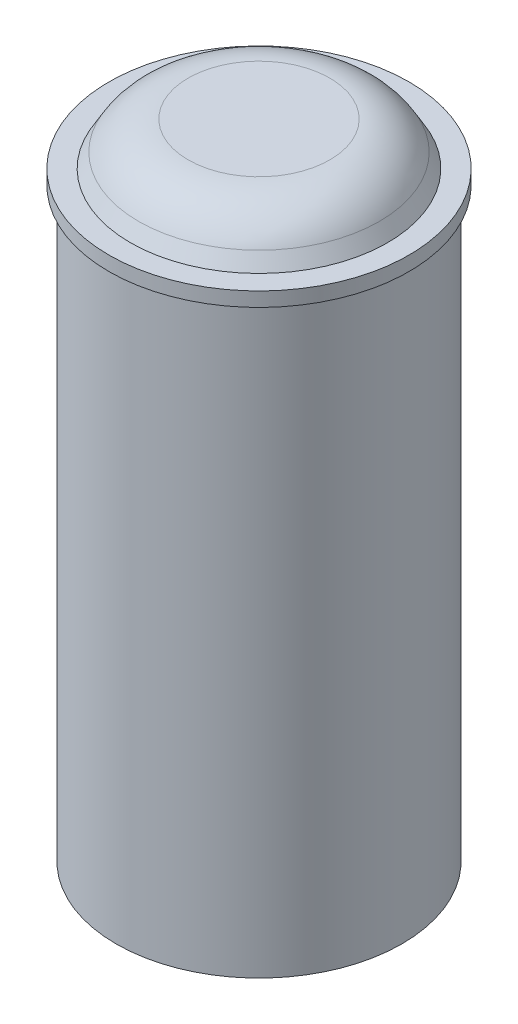
ISO-10303-21;
HEADER;
FILE_DESCRIPTION(('STEP AP214'),'2;1');
FILE_NAME('part.step','',(''),(''),'','','');
FILE_SCHEMA(('AUTOMOTIVE_DESIGN { 1 0 10303 214 1 1 1 1 }'));
ENDSEC;
DATA;
#1=APPLICATION_CONTEXT('core data for automotive mechanical design processes');
#2=APPLICATION_PROTOCOL_DEFINITION('international standard','automotive_design',2000,#1);
#3=PRODUCT_CONTEXT('',#1,'mechanical');
#4=PRODUCT('Part','Part','',(#3));
#5=PRODUCT_RELATED_PRODUCT_CATEGORY('part','',(#4));
#6=PRODUCT_DEFINITION_FORMATION('','',#4);
#7=PRODUCT_DEFINITION_CONTEXT('part definition',#1,'design');
#8=PRODUCT_DEFINITION('design','',#6,#7);
#9=PRODUCT_DEFINITION_SHAPE('','',#8);
#10=(LENGTH_UNIT() NAMED_UNIT(*) SI_UNIT(.MILLI.,.METRE.));
#11=(NAMED_UNIT(*) PLANE_ANGLE_UNIT() SI_UNIT($,.RADIAN.));
#12=(NAMED_UNIT(*) SI_UNIT($,.STERADIAN.) SOLID_ANGLE_UNIT());
#13=UNCERTAINTY_MEASURE_WITH_UNIT(LENGTH_MEASURE(1.E-05),#10,'distance_accuracy_value','');
#14=(GEOMETRIC_REPRESENTATION_CONTEXT(3) GLOBAL_UNCERTAINTY_ASSIGNED_CONTEXT((#13)) GLOBAL_UNIT_ASSIGNED_CONTEXT((#10,
#11,#12)) REPRESENTATION_CONTEXT('',''));
#15=CARTESIAN_POINT('',(0.,0.,0.));
#16=DIRECTION('',(0.,0.,1.));
#17=DIRECTION('',(1.,0.,0.));
#18=AXIS2_PLACEMENT_3D('',#15,#16,#17);
#19=CARTESIAN_POINT('',(0.,53.34,0.));
#20=DIRECTION('',(0.,1.,0.));
#21=DIRECTION('',(0.,0.,1.));
#22=AXIS2_PLACEMENT_3D('',#19,#20,#21);
#23=PLANE('',#22);
#24=CARTESIAN_POINT('',(0.,53.34,0.));
#25=DIRECTION('',(0.,1.,0.));
#26=DIRECTION('',(0.,0.,1.));
#27=AXIS2_PLACEMENT_3D('',#24,#25,#26);
#28=CIRCLE('',#27,13.335);
#29=CARTESIAN_POINT('',(0.,53.34,13.335));
#30=VERTEX_POINT('',#29);
#31=EDGE_CURVE('E170',#30,#30,#28,.T.);
#32=ORIENTED_EDGE('',*,*,#31,.T.);
#33=EDGE_LOOP('',(#32));
#34=FACE_BOUND('',#33,.T.);
#35=CARTESIAN_POINT('',(0.,53.34,0.));
#36=DIRECTION('',(0.,1.,0.));
#37=DIRECTION('',(0.,0.,1.));
#38=AXIS2_PLACEMENT_3D('',#35,#36,#37);
#39=CIRCLE('',#38,11.43);
#40=CARTESIAN_POINT('',(0.,53.34,11.43));
#41=VERTEX_POINT('',#40);
#42=EDGE_CURVE('E174',#41,#41,#39,.T.);
#43=ORIENTED_EDGE('',*,*,#42,.F.);
#44=EDGE_LOOP('',(#43));
#45=FACE_BOUND('',#44,.T.);
#46=ADVANCED_FACE('F89',(#34,#45),#23,.T.);
#47=CARTESIAN_POINT('',(0.,1.27,0.));
#48=DIRECTION('',(0.,-1.,0.));
#49=DIRECTION('',(0.,0.,-1.));
#50=AXIS2_PLACEMENT_3D('',#47,#48,#49);
#51=CYLINDRICAL_SURFACE('',#50,12.7);
#52=CARTESIAN_POINT('',(0.,0.,0.));
#53=DIRECTION('',(0.,1.,0.));
#54=DIRECTION('',(0.,0.,1.));
#55=AXIS2_PLACEMENT_3D('',#52,#53,#54);
#56=CIRCLE('',#55,12.7);
#57=CARTESIAN_POINT('',(0.,0.,12.7));
#58=VERTEX_POINT('',#57);
#59=EDGE_CURVE('E105',#58,#58,#56,.T.);
#60=ORIENTED_EDGE('',*,*,#59,.T.);
#61=EDGE_LOOP('',(#60));
#62=FACE_BOUND('',#61,.T.);
#63=CARTESIAN_POINT('',(0.,52.07,0.));
#64=DIRECTION('',(0.,1.,0.));
#65=DIRECTION('',(0.,0.,1.));
#66=AXIS2_PLACEMENT_3D('',#63,#64,#65);
#67=CIRCLE('',#66,12.7);
#68=CARTESIAN_POINT('',(0.,52.07,12.7));
#69=VERTEX_POINT('',#68);
#70=EDGE_CURVE('E110',#69,#69,#67,.T.);
#71=ORIENTED_EDGE('',*,*,#70,.F.);
#72=EDGE_LOOP('',(#71));
#73=FACE_BOUND('',#72,.T.);
#74=ADVANCED_FACE('F183',(#62,#73),#51,.T.);
#75=CARTESIAN_POINT('',(0.,0.,0.));
#76=DIRECTION('',(0.,1.,0.));
#77=DIRECTION('',(0.,0.,1.));
#78=AXIS2_PLACEMENT_3D('',#75,#76,#77);
#79=PLANE('',#78);
#80=ORIENTED_EDGE('',*,*,#59,.F.);
#81=EDGE_LOOP('',(#80));
#82=FACE_BOUND('',#81,.T.);
#83=ADVANCED_FACE('F191',(#82),#79,.F.);
#84=CARTESIAN_POINT('',(0.,52.07,0.));
#85=DIRECTION('',(0.,1.,0.));
#86=DIRECTION('',(0.,0.,1.));
#87=AXIS2_PLACEMENT_3D('',#84,#85,#86);
#88=PLANE('',#87);
#89=CARTESIAN_POINT('',(0.,52.07,0.));
#90=DIRECTION('',(0.,1.,0.));
#91=DIRECTION('',(0.,0.,1.));
#92=AXIS2_PLACEMENT_3D('',#89,#90,#91);
#93=CIRCLE('',#92,13.335);
#94=CARTESIAN_POINT('',(0.,52.07,13.335));
#95=VERTEX_POINT('',#94);
#96=EDGE_CURVE('E171',#95,#95,#93,.T.);
#97=ORIENTED_EDGE('',*,*,#96,.F.);
#98=EDGE_LOOP('',(#97));
#99=FACE_BOUND('',#98,.T.);
#100=ORIENTED_EDGE('',*,*,#70,.T.);
#101=EDGE_LOOP('',(#100));
#102=FACE_BOUND('',#101,.T.);
#103=ADVANCED_FACE('F196',(#99,#102),#88,.F.);
#104=CARTESIAN_POINT('',(0.,53.34,0.));
#105=DIRECTION('',(0.,-1.,0.));
#106=DIRECTION('',(0.,0.,-1.));
#107=AXIS2_PLACEMENT_3D('',#104,#105,#106);
#108=CYLINDRICAL_SURFACE('',#107,13.335);
#109=ORIENTED_EDGE('',*,*,#31,.F.);
#110=EDGE_LOOP('',(#109));
#111=FACE_BOUND('',#110,.T.);
#112=ORIENTED_EDGE('',*,*,#96,.T.);
#113=EDGE_LOOP('',(#112));
#114=FACE_BOUND('',#113,.T.);
#115=ADVANCED_FACE('F199',(#111,#114),#108,.T.);
#116=CARTESIAN_POINT('',(0.,53.34,0.));
#117=DIRECTION('',(0.,-1.,0.));
#118=DIRECTION('',(0.,0.,1.));
#119=AXIS2_PLACEMENT_3D('',#116,#117,#118);
#120=CONICAL_SURFACE('',#119,11.43,0.5235987755983);
#121=CARTESIAN_POINT('',(0.,54.61,0.));
#122=DIRECTION('',(0.,-1.,0.));
#123=DIRECTION('',(0.,0.,-1.));
#124=AXIS2_PLACEMENT_3D('',#121,#122,#123);
#125=CIRCLE('',#124,10.6967651581292);
#126=CARTESIAN_POINT('',(0.,54.61,-10.6967651581292));
#127=VERTEX_POINT('',#126);
#128=EDGE_CURVE('E11',#127,#127,#125,.T.);
#129=ORIENTED_EDGE('',*,*,#128,.T.);
#130=EDGE_LOOP('',(#129));
#131=FACE_BOUND('',#130,.T.);
#132=ORIENTED_EDGE('',*,*,#42,.T.);
#133=EDGE_LOOP('',(#132));
#134=FACE_BOUND('',#133,.T.);
#135=ADVANCED_FACE('F180',(#131,#134),#120,.T.);
#136=CARTESIAN_POINT('',(0.,57.15,0.));
#137=DIRECTION('',(0.,1.,0.));
#138=DIRECTION('',(0.,0.,1.));
#139=AXIS2_PLACEMENT_3D('',#136,#137,#138);
#140=PLANE('',#139);
#141=CARTESIAN_POINT('',(0.,57.15,0.));
#142=DIRECTION('',(0.,1.,0.));
#143=DIRECTION('',(0.,0.,1.));
#144=AXIS2_PLACEMENT_3D('',#141,#142,#143);
#145=CIRCLE('',#144,6.29735610690422);
#146=CARTESIAN_POINT('',(0.,57.15,6.29735610690422));
#147=VERTEX_POINT('',#146);
#148=EDGE_CURVE('E97',#147,#147,#145,.T.);
#149=ORIENTED_EDGE('',*,*,#148,.T.);
#150=EDGE_LOOP('',(#149));
#151=FACE_BOUND('',#150,.T.);
#152=ADVANCED_FACE('F278',(#151),#140,.T.);
#153=CARTESIAN_POINT('',(0.,52.07,0.));
#154=DIRECTION('',(0.,1.,0.));
#155=DIRECTION('',(0.,0.,1.));
#156=AXIS2_PLACEMENT_3D('',#153,#154,#155);
#157=TOROIDAL_SURFACE('',#156,6.29735610690422,5.08);
#158=ORIENTED_EDGE('',*,*,#128,.F.);
#159=EDGE_LOOP('',(#158));
#160=FACE_BOUND('',#159,.T.);
#161=ORIENTED_EDGE('',*,*,#148,.F.);
#162=EDGE_LOOP('',(#161));
#163=FACE_BOUND('',#162,.T.);
#164=ADVANCED_FACE('F91',(#160,#163),#157,.T.);
#165=CLOSED_SHELL('',(#46,#74,#83,#103,#115,#135,#152,#164));
#166=CARTESIAN_POINT('',(0.,52.07,0.));
#167=DIRECTION('',(0.,1.,0.));
#168=DIRECTION('',(0.,0.,1.));
#169=AXIS2_PLACEMENT_3D('',#166,#167,#168);
#170=CIRCLE('',#169,11.43);
#171=CARTESIAN_POINT('',(0.,52.07,11.43));
#172=VERTEX_POINT('',#171);
#173=EDGE_CURVE('E165',#172,#172,#170,.T.);
#174=ORIENTED_EDGE('',*,*,#173,.F.);
#175=EDGE_LOOP('',(#174));
#176=FACE_BOUND('',#175,.T.);
#177=CARTESIAN_POINT('',(-4.49012806053452,52.07,-4.49012806053463));
#178=DIRECTION('',(0.,1.,0.));
#179=DIRECTION('',(0.,0.,1.));
#180=AXIS2_PLACEMENT_3D('',#177,#178,#179);
#181=CIRCLE('',#180,1.27);
#182=CARTESIAN_POINT('',(-4.49012806053452,52.07,-3.22012806053463));
#183=VERTEX_POINT('',#182);
#184=EDGE_CURVE('E117',#183,#183,#181,.T.);
#185=ORIENTED_EDGE('',*,*,#184,.T.);
#186=EDGE_LOOP('',(#185));
#187=FACE_BOUND('',#186,.T.);
#188=CARTESIAN_POINT('',(0.,52.07,0.));
#189=DIRECTION('',(0.,1.,0.));
#190=DIRECTION('',(0.,0.,1.));
#191=AXIS2_PLACEMENT_3D('',#188,#189,#190);
#192=CIRCLE('',#191,2.54);
#193=CARTESIAN_POINT('',(0.,52.07,2.54));
#194=VERTEX_POINT('',#193);
#195=EDGE_CURVE('E129',#194,#194,#192,.T.);
#196=ORIENTED_EDGE('',*,*,#195,.T.);
#197=EDGE_LOOP('',(#196));
#198=FACE_BOUND('',#197,.T.);
#199=CARTESIAN_POINT('',(4.49012806053458,52.07,-4.49012806053457));
#200=DIRECTION('',(0.,1.,0.));
#201=DIRECTION('',(0.,0.,1.));
#202=AXIS2_PLACEMENT_3D('',#199,#200,#201);
#203=CIRCLE('',#202,1.27);
#204=CARTESIAN_POINT('',(4.49012806053458,52.07,-3.22012806053457));
#205=VERTEX_POINT('',#204);
#206=EDGE_CURVE('E141',#205,#205,#203,.T.);
#207=ORIENTED_EDGE('',*,*,#206,.T.);
#208=EDGE_LOOP('',(#207));
#209=FACE_BOUND('',#208,.T.);
#210=CARTESIAN_POINT('',(4.49012806053455,52.07,4.4901280605346));
#211=DIRECTION('',(0.,1.,0.));
#212=DIRECTION('',(0.,0.,1.));
#213=AXIS2_PLACEMENT_3D('',#210,#211,#212);
#214=CIRCLE('',#213,1.27);
#215=CARTESIAN_POINT('',(4.49012806053455,52.07,5.7601280605346));
#216=VERTEX_POINT('',#215);
#217=EDGE_CURVE('E153',#216,#216,#214,.T.);
#218=ORIENTED_EDGE('',*,*,#217,.T.);
#219=EDGE_LOOP('',(#218));
#220=FACE_BOUND('',#219,.T.);
#221=CARTESIAN_POINT('',(0.,52.07,6.35));
#222=DIRECTION('',(0.,1.,0.));
#223=DIRECTION('',(0.,0.,1.));
#224=AXIS2_PLACEMENT_3D('',#221,#222,#223);
#225=CIRCLE('',#224,1.27);
#226=CARTESIAN_POINT('',(0.,52.07,7.62));
#227=VERTEX_POINT('',#226);
#228=EDGE_CURVE('E159',#227,#227,#225,.T.);
#229=ORIENTED_EDGE('',*,*,#228,.T.);
#230=EDGE_LOOP('',(#229));
#231=FACE_BOUND('',#230,.T.);
#232=CARTESIAN_POINT('',(6.35,52.07,0.));
#233=DIRECTION('',(0.,1.,0.));
#234=DIRECTION('',(0.,0.,1.));
#235=AXIS2_PLACEMENT_3D('',#232,#233,#234);
#236=CIRCLE('',#235,1.27);
#237=CARTESIAN_POINT('',(6.35,52.07,1.27000000000002));
#238=VERTEX_POINT('',#237);
#239=EDGE_CURVE('E147',#238,#238,#236,.T.);
#240=ORIENTED_EDGE('',*,*,#239,.T.);
#241=EDGE_LOOP('',(#240));
#242=FACE_BOUND('',#241,.T.);
#243=CARTESIAN_POINT('',(0.,52.07,-6.35));
#244=DIRECTION('',(0.,1.,0.));
#245=DIRECTION('',(0.,0.,1.));
#246=AXIS2_PLACEMENT_3D('',#243,#244,#245);
#247=CIRCLE('',#246,1.27);
#248=CARTESIAN_POINT('',(0.,52.07,-5.08));
#249=VERTEX_POINT('',#248);
#250=EDGE_CURVE('E135',#249,#249,#247,.T.);
#251=ORIENTED_EDGE('',*,*,#250,.T.);
#252=EDGE_LOOP('',(#251));
#253=FACE_BOUND('',#252,.T.);
#254=CARTESIAN_POINT('',(-4.49012806053462,52.07,4.49012806053454));
#255=DIRECTION('',(0.,1.,0.));
#256=DIRECTION('',(0.,0.,1.));
#257=AXIS2_PLACEMENT_3D('',#254,#255,#256);
#258=CIRCLE('',#257,1.27);
#259=CARTESIAN_POINT('',(-4.49012806053462,52.07,5.76012806053454));
#260=VERTEX_POINT('',#259);
#261=EDGE_CURVE('E123',#260,#260,#258,.T.);
#262=ORIENTED_EDGE('',*,*,#261,.T.);
#263=EDGE_LOOP('',(#262));
#264=FACE_BOUND('',#263,.T.);
#265=CARTESIAN_POINT('',(-6.35,52.07,0.));
#266=DIRECTION('',(0.,1.,0.));
#267=DIRECTION('',(0.,0.,1.));
#268=AXIS2_PLACEMENT_3D('',#265,#266,#267);
#269=CIRCLE('',#268,1.27);
#270=CARTESIAN_POINT('',(-6.35,52.07,1.26999999999993));
#271=VERTEX_POINT('',#270);
#272=EDGE_CURVE('E113',#271,#271,#269,.T.);
#273=ORIENTED_EDGE('',*,*,#272,.T.);
#274=EDGE_LOOP('',(#273));
#275=FACE_BOUND('',#274,.T.);
#276=ADVANCED_FACE('F201',(#176,#187,#198,#209,#220,#231,#242,#253,#264,#275),#88,.F.);
#277=CARTESIAN_POINT('',(6.35,52.07,0.));
#278=DIRECTION('',(0.,-1.,0.));
#279=DIRECTION('',(0.,0.,-1.));
#280=AXIS2_PLACEMENT_3D('',#277,#278,#279);
#281=CYLINDRICAL_SURFACE('',#280,1.27);
#282=ORIENTED_EDGE('',*,*,#239,.F.);
#283=EDGE_LOOP('',(#282));
#284=FACE_BOUND('',#283,.T.);
#285=CARTESIAN_POINT('',(6.35,1.27,0.));
#286=DIRECTION('',(0.,1.,0.));
#287=DIRECTION('',(0.,0.,1.));
#288=AXIS2_PLACEMENT_3D('',#285,#286,#287);
#289=CIRCLE('',#288,1.27);
#290=CARTESIAN_POINT('',(6.35,1.27,1.27000000000002));
#291=VERTEX_POINT('',#290);
#292=EDGE_CURVE('E150',#291,#291,#289,.T.);
#293=ORIENTED_EDGE('',*,*,#292,.T.);
#294=EDGE_LOOP('',(#293));
#295=FACE_BOUND('',#294,.T.);
#296=ADVANCED_FACE('F215',(#284,#295),#281,.T.);
#297=CARTESIAN_POINT('',(0.,52.07,-6.35));
#298=DIRECTION('',(0.,-1.,0.));
#299=DIRECTION('',(0.,0.,-1.));
#300=AXIS2_PLACEMENT_3D('',#297,#298,#299);
#301=CYLINDRICAL_SURFACE('',#300,1.27);
#302=ORIENTED_EDGE('',*,*,#250,.F.);
#303=EDGE_LOOP('',(#302));
#304=FACE_BOUND('',#303,.T.);
#305=CARTESIAN_POINT('',(0.,1.27,-6.35));
#306=DIRECTION('',(0.,1.,0.));
#307=DIRECTION('',(0.,0.,1.));
#308=AXIS2_PLACEMENT_3D('',#305,#306,#307);
#309=CIRCLE('',#308,1.27);
#310=CARTESIAN_POINT('',(0.,1.27,-5.08));
#311=VERTEX_POINT('',#310);
#312=EDGE_CURVE('E138',#311,#311,#309,.T.);
#313=ORIENTED_EDGE('',*,*,#312,.T.);
#314=EDGE_LOOP('',(#313));
#315=FACE_BOUND('',#314,.T.);
#316=ADVANCED_FACE('F218',(#304,#315),#301,.T.);
#317=CARTESIAN_POINT('',(-4.49012806053462,52.07,4.49012806053454));
#318=DIRECTION('',(0.,-1.,0.));
#319=DIRECTION('',(0.,0.,-1.));
#320=AXIS2_PLACEMENT_3D('',#317,#318,#319);
#321=CYLINDRICAL_SURFACE('',#320,1.27);
#322=ORIENTED_EDGE('',*,*,#261,.F.);
#323=EDGE_LOOP('',(#322));
#324=FACE_BOUND('',#323,.T.);
#325=CARTESIAN_POINT('',(-4.49012806053462,1.27,4.49012806053454));
#326=DIRECTION('',(0.,1.,0.));
#327=DIRECTION('',(0.,0.,1.));
#328=AXIS2_PLACEMENT_3D('',#325,#326,#327);
#329=CIRCLE('',#328,1.27);
#330=CARTESIAN_POINT('',(-4.49012806053462,1.27,5.76012806053454));
#331=VERTEX_POINT('',#330);
#332=EDGE_CURVE('E126',#331,#331,#329,.T.);
#333=ORIENTED_EDGE('',*,*,#332,.T.);
#334=EDGE_LOOP('',(#333));
#335=FACE_BOUND('',#334,.T.);
#336=ADVANCED_FACE('F226',(#324,#335),#321,.T.);
#337=CARTESIAN_POINT('',(-6.35,52.07,0.));
#338=DIRECTION('',(0.,-1.,0.));
#339=DIRECTION('',(0.,0.,-1.));
#340=AXIS2_PLACEMENT_3D('',#337,#338,#339);
#341=CYLINDRICAL_SURFACE('',#340,1.27);
#342=ORIENTED_EDGE('',*,*,#272,.F.);
#343=EDGE_LOOP('',(#342));
#344=FACE_BOUND('',#343,.T.);
#345=CARTESIAN_POINT('',(-6.35,1.27,0.));
#346=DIRECTION('',(0.,1.,0.));
#347=DIRECTION('',(0.,0.,1.));
#348=AXIS2_PLACEMENT_3D('',#345,#346,#347);
#349=CIRCLE('',#348,1.27);
#350=CARTESIAN_POINT('',(-6.35,1.27,1.26999999999993));
#351=VERTEX_POINT('',#350);
#352=EDGE_CURVE('E114',#351,#351,#349,.T.);
#353=ORIENTED_EDGE('',*,*,#352,.T.);
#354=EDGE_LOOP('',(#353));
#355=FACE_BOUND('',#354,.T.);
#356=ADVANCED_FACE('F234',(#344,#355),#341,.T.);
#357=CARTESIAN_POINT('',(0.,52.07,0.));
#358=DIRECTION('',(0.,-1.,0.));
#359=DIRECTION('',(0.,0.,-1.));
#360=AXIS2_PLACEMENT_3D('',#357,#358,#359);
#361=CYLINDRICAL_SURFACE('',#360,11.43);
#362=ORIENTED_EDGE('',*,*,#173,.T.);
#363=EDGE_LOOP('',(#362));
#364=FACE_BOUND('',#363,.T.);
#365=CARTESIAN_POINT('',(0.,1.27,0.));
#366=DIRECTION('',(0.,1.,0.));
#367=DIRECTION('',(0.,0.,1.));
#368=AXIS2_PLACEMENT_3D('',#365,#366,#367);
#369=CIRCLE('',#368,11.43);
#370=CARTESIAN_POINT('',(0.,1.27,11.43));
#371=VERTEX_POINT('',#370);
#372=EDGE_CURVE('E101',#371,#371,#369,.F.);
#373=ORIENTED_EDGE('',*,*,#372,.T.);
#374=EDGE_LOOP('',(#373));
#375=FACE_BOUND('',#374,.T.);
#376=ADVANCED_FACE('F238',(#364,#375),#361,.F.);
#377=CARTESIAN_POINT('',(-4.49012806053452,52.07,-4.49012806053463));
#378=DIRECTION('',(0.,-1.,0.));
#379=DIRECTION('',(0.,0.,-1.));
#380=AXIS2_PLACEMENT_3D('',#377,#378,#379);
#381=CYLINDRICAL_SURFACE('',#380,1.27);
#382=ORIENTED_EDGE('',*,*,#184,.F.);
#383=EDGE_LOOP('',(#382));
#384=FACE_BOUND('',#383,.T.);
#385=CARTESIAN_POINT('',(-4.49012806053452,1.27,-4.49012806053463));
#386=DIRECTION('',(0.,1.,0.));
#387=DIRECTION('',(0.,0.,1.));
#388=AXIS2_PLACEMENT_3D('',#385,#386,#387);
#389=CIRCLE('',#388,1.27);
#390=CARTESIAN_POINT('',(-4.49012806053452,1.27,-3.22012806053463));
#391=VERTEX_POINT('',#390);
#392=EDGE_CURVE('E120',#391,#391,#389,.T.);
#393=ORIENTED_EDGE('',*,*,#392,.T.);
#394=EDGE_LOOP('',(#393));
#395=FACE_BOUND('',#394,.T.);
#396=ADVANCED_FACE('F230',(#384,#395),#381,.T.);
#397=CARTESIAN_POINT('',(0.,52.07,0.));
#398=DIRECTION('',(0.,-1.,0.));
#399=DIRECTION('',(0.,0.,-1.));
#400=AXIS2_PLACEMENT_3D('',#397,#398,#399);
#401=CYLINDRICAL_SURFACE('',#400,2.54);
#402=ORIENTED_EDGE('',*,*,#195,.F.);
#403=EDGE_LOOP('',(#402));
#404=FACE_BOUND('',#403,.T.);
#405=CARTESIAN_POINT('',(0.,1.27,0.));
#406=DIRECTION('',(0.,1.,0.));
#407=DIRECTION('',(0.,0.,1.));
#408=AXIS2_PLACEMENT_3D('',#405,#406,#407);
#409=CIRCLE('',#408,2.54);
#410=CARTESIAN_POINT('',(0.,1.27,2.54));
#411=VERTEX_POINT('',#410);
#412=EDGE_CURVE('E132',#411,#411,#409,.T.);
#413=ORIENTED_EDGE('',*,*,#412,.T.);
#414=EDGE_LOOP('',(#413));
#415=FACE_BOUND('',#414,.T.);
#416=ADVANCED_FACE('F222',(#404,#415),#401,.T.);
#417=CARTESIAN_POINT('',(4.49012806053458,52.07,-4.49012806053457));
#418=DIRECTION('',(0.,-1.,0.));
#419=DIRECTION('',(0.,0.,-1.));
#420=AXIS2_PLACEMENT_3D('',#417,#418,#419);
#421=CYLINDRICAL_SURFACE('',#420,1.27);
#422=ORIENTED_EDGE('',*,*,#206,.F.);
#423=EDGE_LOOP('',(#422));
#424=FACE_BOUND('',#423,.T.);
#425=CARTESIAN_POINT('',(4.49012806053458,1.27,-4.49012806053457));
#426=DIRECTION('',(0.,1.,0.));
#427=DIRECTION('',(0.,0.,1.));
#428=AXIS2_PLACEMENT_3D('',#425,#426,#427);
#429=CIRCLE('',#428,1.27);
#430=CARTESIAN_POINT('',(4.49012806053458,1.27,-3.22012806053457));
#431=VERTEX_POINT('',#430);
#432=EDGE_CURVE('E144',#431,#431,#429,.T.);
#433=ORIENTED_EDGE('',*,*,#432,.T.);
#434=EDGE_LOOP('',(#433));
#435=FACE_BOUND('',#434,.T.);
#436=ADVANCED_FACE('F213',(#424,#435),#421,.T.);
#437=CARTESIAN_POINT('',(4.49012806053455,52.07,4.4901280605346));
#438=DIRECTION('',(0.,-1.,0.));
#439=DIRECTION('',(0.,0.,-1.));
#440=AXIS2_PLACEMENT_3D('',#437,#438,#439);
#441=CYLINDRICAL_SURFACE('',#440,1.27);
#442=ORIENTED_EDGE('',*,*,#217,.F.);
#443=EDGE_LOOP('',(#442));
#444=FACE_BOUND('',#443,.T.);
#445=CARTESIAN_POINT('',(4.49012806053455,1.27,4.4901280605346));
#446=DIRECTION('',(0.,1.,0.));
#447=DIRECTION('',(0.,0.,1.));
#448=AXIS2_PLACEMENT_3D('',#445,#446,#447);
#449=CIRCLE('',#448,1.27);
#450=CARTESIAN_POINT('',(4.49012806053455,1.27,5.7601280605346));
#451=VERTEX_POINT('',#450);
#452=EDGE_CURVE('E156',#451,#451,#449,.T.);
#453=ORIENTED_EDGE('',*,*,#452,.T.);
#454=EDGE_LOOP('',(#453));
#455=FACE_BOUND('',#454,.T.);
#456=ADVANCED_FACE('F210',(#444,#455),#441,.T.);
#457=CARTESIAN_POINT('',(0.,1.27,0.));
#458=DIRECTION('',(0.,1.,0.));
#459=DIRECTION('',(0.,0.,1.));
#460=AXIS2_PLACEMENT_3D('',#457,#458,#459);
#461=PLANE('',#460);
#462=ORIENTED_EDGE('',*,*,#452,.F.);
#463=EDGE_LOOP('',(#462));
#464=FACE_BOUND('',#463,.T.);
#465=ORIENTED_EDGE('',*,*,#432,.F.);
#466=EDGE_LOOP('',(#465));
#467=FACE_BOUND('',#466,.T.);
#468=ORIENTED_EDGE('',*,*,#412,.F.);
#469=EDGE_LOOP('',(#468));
#470=FACE_BOUND('',#469,.T.);
#471=ORIENTED_EDGE('',*,*,#392,.F.);
#472=EDGE_LOOP('',(#471));
#473=FACE_BOUND('',#472,.T.);
#474=ORIENTED_EDGE('',*,*,#372,.F.);
#475=EDGE_LOOP('',(#474));
#476=FACE_BOUND('',#475,.T.);
#477=ORIENTED_EDGE('',*,*,#352,.F.);
#478=EDGE_LOOP('',(#477));
#479=FACE_BOUND('',#478,.T.);
#480=ORIENTED_EDGE('',*,*,#332,.F.);
#481=EDGE_LOOP('',(#480));
#482=FACE_BOUND('',#481,.T.);
#483=ORIENTED_EDGE('',*,*,#312,.F.);
#484=EDGE_LOOP('',(#483));
#485=FACE_BOUND('',#484,.T.);
#486=ORIENTED_EDGE('',*,*,#292,.F.);
#487=EDGE_LOOP('',(#486));
#488=FACE_BOUND('',#487,.T.);
#489=CARTESIAN_POINT('',(0.,1.27,6.35));
#490=DIRECTION('',(0.,1.,0.));
#491=DIRECTION('',(0.,0.,1.));
#492=AXIS2_PLACEMENT_3D('',#489,#490,#491);
#493=CIRCLE('',#492,1.27);
#494=CARTESIAN_POINT('',(0.,1.27,7.62));
#495=VERTEX_POINT('',#494);
#496=EDGE_CURVE('E162',#495,#495,#493,.T.);
#497=ORIENTED_EDGE('',*,*,#496,.F.);
#498=EDGE_LOOP('',(#497));
#499=FACE_BOUND('',#498,.T.);
#500=ADVANCED_FACE('F207',(#464,#467,#470,#473,#476,#479,#482,#485,#488,#499),#461,.T.);
#501=CARTESIAN_POINT('',(0.,52.07,6.35));
#502=DIRECTION('',(0.,-1.,0.));
#503=DIRECTION('',(0.,0.,-1.));
#504=AXIS2_PLACEMENT_3D('',#501,#502,#503);
#505=CYLINDRICAL_SURFACE('',#504,1.27);
#506=ORIENTED_EDGE('',*,*,#228,.F.);
#507=EDGE_LOOP('',(#506));
#508=FACE_BOUND('',#507,.T.);
#509=ORIENTED_EDGE('',*,*,#496,.T.);
#510=EDGE_LOOP('',(#509));
#511=FACE_BOUND('',#510,.T.);
#512=ADVANCED_FACE('F204',(#508,#511),#505,.T.);
#513=CLOSED_SHELL('',(#276,#296,#316,#336,#356,#376,#396,#416,#436,#456,#500,#512));
#514=ORIENTED_CLOSED_SHELL('',*,#513,.T.);
#515=BREP_WITH_VOIDS('B2',#165,(#514));
#516=ADVANCED_BREP_SHAPE_REPRESENTATION('',(#18,#515),#14);
#517=SHAPE_DEFINITION_REPRESENTATION(#9,#516);
ENDSEC;
END-ISO-10303-21;
